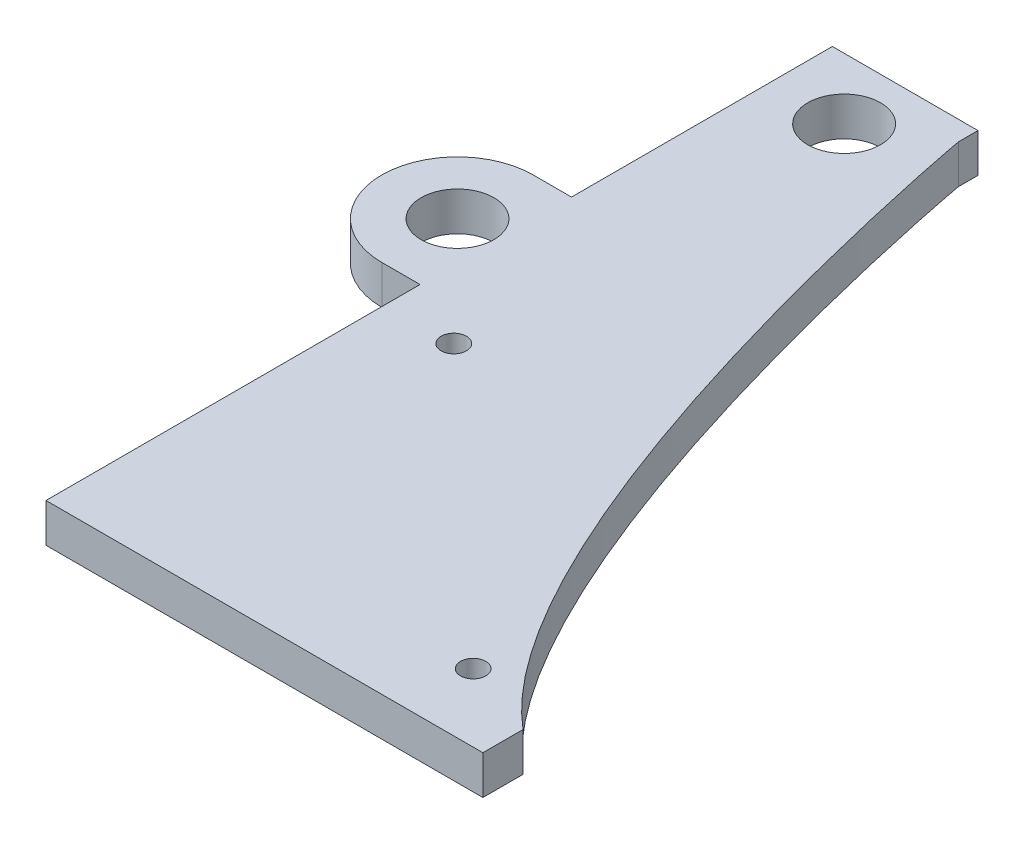
ISO-10303-21;
HEADER;
FILE_DESCRIPTION(('STEP AP214'),'2;1');
FILE_NAME('part.step','',(''),(''),'','','');
FILE_SCHEMA(('AUTOMOTIVE_DESIGN { 1 0 10303 214 1 1 1 1 }'));
ENDSEC;
DATA;
#1=APPLICATION_CONTEXT('core data for automotive mechanical design processes');
#2=APPLICATION_PROTOCOL_DEFINITION('international standard','automotive_design',2000,#1);
#3=PRODUCT_CONTEXT('',#1,'mechanical');
#4=PRODUCT('Part','Part','',(#3));
#5=PRODUCT_RELATED_PRODUCT_CATEGORY('part','',(#4));
#6=PRODUCT_DEFINITION_FORMATION('','',#4);
#7=PRODUCT_DEFINITION_CONTEXT('part definition',#1,'design');
#8=PRODUCT_DEFINITION('design','',#6,#7);
#9=PRODUCT_DEFINITION_SHAPE('','',#8);
#10=(LENGTH_UNIT() NAMED_UNIT(*) SI_UNIT(.MILLI.,.METRE.));
#11=(NAMED_UNIT(*) PLANE_ANGLE_UNIT() SI_UNIT($,.RADIAN.));
#12=(NAMED_UNIT(*) SI_UNIT($,.STERADIAN.) SOLID_ANGLE_UNIT());
#13=UNCERTAINTY_MEASURE_WITH_UNIT(LENGTH_MEASURE(1.E-05),#10,'distance_accuracy_value','');
#14=(GEOMETRIC_REPRESENTATION_CONTEXT(3) GLOBAL_UNCERTAINTY_ASSIGNED_CONTEXT((#13)) GLOBAL_UNIT_ASSIGNED_CONTEXT((#10,
#11,#12)) REPRESENTATION_CONTEXT('',''));
#15=CARTESIAN_POINT('',(0.,0.,0.));
#16=DIRECTION('',(0.,0.,1.));
#17=DIRECTION('',(1.,0.,0.));
#18=AXIS2_PLACEMENT_3D('',#15,#16,#17);
#19=CARTESIAN_POINT('',(-9.525,5.08,48.8950000000001));
#20=DIRECTION('',(1.,0.,0.));
#21=DIRECTION('',(0.,0.,-1.));
#22=AXIS2_PLACEMENT_3D('',#19,#20,#21);
#23=PLANE('',#22);
#24=DIRECTION('',(0.,0.,1.));
#25=VECTOR('',#24,1.);
#26=CARTESIAN_POINT('',(-9.525,5.08,48.8950000000001));
#27=LINE('',#26,#25);
#28=CARTESIAN_POINT('',(-9.52499999999999,5.08,-0.0375919999999405));
#29=VERTEX_POINT('',#28);
#30=CARTESIAN_POINT('',(-9.525,5.08,48.8950000000001));
#31=VERTEX_POINT('',#30);
#32=EDGE_CURVE('E55',#29,#31,#27,.T.);
#33=ORIENTED_EDGE('',*,*,#32,.F.);
#34=DIRECTION('',(0.,-1.,0.));
#35=VECTOR('',#34,1.);
#36=CARTESIAN_POINT('',(-9.52499999999998,5.08,-0.0375919999999405));
#37=LINE('',#36,#35);
#38=CARTESIAN_POINT('',(-9.52499999999999,0.,-0.0375919999999405));
#39=VERTEX_POINT('',#38);
#40=EDGE_CURVE('E245',#29,#39,#37,.T.);
#41=ORIENTED_EDGE('',*,*,#40,.T.);
#42=DIRECTION('',(0.,0.,1.));
#43=VECTOR('',#42,1.);
#44=CARTESIAN_POINT('',(-9.525,0.,48.8950000000001));
#45=LINE('',#44,#43);
#46=CARTESIAN_POINT('',(-9.525,0.,48.8950000000001));
#47=VERTEX_POINT('',#46);
#48=EDGE_CURVE('E152',#39,#47,#45,.T.);
#49=ORIENTED_EDGE('',*,*,#48,.T.);
#50=DIRECTION('',(0.,-1.,0.));
#51=VECTOR('',#50,1.);
#52=CARTESIAN_POINT('',(-9.525,5.08,48.8950000000001));
#53=LINE('',#52,#51);
#54=EDGE_CURVE('E156',#31,#47,#53,.T.);
#55=ORIENTED_EDGE('',*,*,#54,.F.);
#56=EDGE_LOOP('',(#33,#41,#49,#55));
#57=FACE_BOUND('',#56,.T.);
#58=ADVANCED_FACE('F37',(#57),#23,.F.);
#59=CARTESIAN_POINT('',(22.7352910938507,5.08,-1.18732961513015));
#60=DIRECTION('',(0.,-1.,0.));
#61=DIRECTION('',(0.,0.,-1.));
#62=AXIS2_PLACEMENT_3D('',#59,#60,#61);
#63=PLANE('',#62);
#64=DIRECTION('',(1.,0.,0.));
#65=VECTOR('',#64,1.);
#66=CARTESIAN_POINT('',(60.325,5.08,48.8950000000001));
#67=LINE('',#66,#65);
#68=CARTESIAN_POINT('',(47.625,5.08,48.8950000000001));
#69=VERTEX_POINT('',#68);
#70=EDGE_CURVE('E186',#31,#69,#67,.T.);
#71=ORIENTED_EDGE('',*,*,#70,.T.);
#72=DIRECTION('',(0.,0.,-1.));
#73=VECTOR('',#72,1.);
#74=CARTESIAN_POINT('',(47.625,5.08,48.8950000000001));
#75=LINE('',#74,#73);
#76=CARTESIAN_POINT('',(47.625,5.08,43.6464868260698));
#77=VERTEX_POINT('',#76);
#78=EDGE_CURVE('E209',#69,#77,#75,.T.);
#79=ORIENTED_EDGE('',*,*,#78,.T.);
#80=CARTESIAN_POINT('',(60.325,5.08,48.895));
#81=CARTESIAN_POINT('',(27.8191095836019,5.08,48.895));
#82=CARTESIAN_POINT('',(9.525,5.08,-51.214545640347));
#83=CARTESIAN_POINT('',(9.525,5.08,-51.435));
#84=B_SPLINE_CURVE_WITH_KNOTS('',3,(#80,#81,#82,#83),.UNSPECIFIED.,.F.,.F.,(4,4),(0.,1.),.UNSPECIFIED.);
#85=CARTESIAN_POINT('',(9.525,5.08,-51.435));
#86=VERTEX_POINT('',#85);
#87=EDGE_CURVE('E136',#77,#86,#84,.T.);
#88=ORIENTED_EDGE('',*,*,#87,.T.);
#89=DIRECTION('',(0.,0.,-1.));
#90=VECTOR('',#89,1.);
#91=CARTESIAN_POINT('',(9.525,5.08,-51.435));
#92=LINE('',#91,#90);
#93=CARTESIAN_POINT('',(9.52499999999999,5.08,-53.9749999999999));
#94=VERTEX_POINT('',#93);
#95=EDGE_CURVE('E143',#86,#94,#92,.T.);
#96=ORIENTED_EDGE('',*,*,#95,.T.);
#97=DIRECTION('',(-1.,0.,0.));
#98=VECTOR('',#97,1.);
#99=CARTESIAN_POINT('',(-9.52499999999998,5.08,-53.9749999999999));
#100=LINE('',#99,#98);
#101=CARTESIAN_POINT('',(-9.52499999999998,5.08,-53.9749999999999));
#102=VERTEX_POINT('',#101);
#103=EDGE_CURVE('E146',#94,#102,#100,.T.);
#104=ORIENTED_EDGE('',*,*,#103,.T.);
#105=CARTESIAN_POINT('',(-9.52499999999999,5.08,-19.8495919999999));
#106=VERTEX_POINT('',#105);
#107=EDGE_CURVE('E262',#102,#106,#27,.T.);
#108=ORIENTED_EDGE('',*,*,#107,.T.);
#109=DIRECTION('',(1.,0.,0.));
#110=VECTOR('',#109,1.);
#111=CARTESIAN_POINT('',(-14.535912,5.08,-19.8495919999999));
#112=LINE('',#111,#110);
#113=CARTESIAN_POINT('',(-14.535912,5.08,-19.8495919999999));
#114=VERTEX_POINT('',#113);
#115=EDGE_CURVE('E227',#114,#106,#112,.T.);
#116=ORIENTED_EDGE('',*,*,#115,.F.);
#117=CARTESIAN_POINT('',(-14.535912,5.08,-9.94359199999994));
#118=DIRECTION('',(0.,-1.,0.));
#119=DIRECTION('',(0.,0.,-1.));
#120=AXIS2_PLACEMENT_3D('',#117,#118,#119);
#121=CIRCLE('',#120,9.906);
#122=CARTESIAN_POINT('',(-14.535912,5.08,-0.0375919999999405));
#123=VERTEX_POINT('',#122);
#124=EDGE_CURVE('E224',#123,#114,#121,.T.);
#125=ORIENTED_EDGE('',*,*,#124,.F.);
#126=DIRECTION('',(-1.,0.,0.));
#127=VECTOR('',#126,1.);
#128=CARTESIAN_POINT('',(-14.535912,5.08,-0.0375919999999405));
#129=LINE('',#128,#127);
#130=EDGE_CURVE('E231',#29,#123,#129,.T.);
#131=ORIENTED_EDGE('',*,*,#130,.F.);
#132=ORIENTED_EDGE('',*,*,#32,.T.);
#133=EDGE_LOOP('',(#71,#79,#88,#96,#104,#108,#116,#125,#131,#132));
#134=FACE_BOUND('',#133,.T.);
#135=CARTESIAN_POINT('',(37.465,5.08,40.0050000000001));
#136=DIRECTION('',(0.,-1.,0.));
#137=DIRECTION('',(0.,0.,-1.));
#138=AXIS2_PLACEMENT_3D('',#135,#136,#137);
#139=CIRCLE('',#138,1.651);
#140=CARTESIAN_POINT('',(37.465,5.08,38.3540000000001));
#141=VERTEX_POINT('',#140);
#142=EDGE_CURVE('E249',#141,#141,#139,.T.);
#143=ORIENTED_EDGE('',*,*,#142,.T.);
#144=EDGE_LOOP('',(#143));
#145=FACE_BOUND('',#144,.T.);
#146=CARTESIAN_POINT('',(-0.634999999999997,5.08,4.44500000000005));
#147=DIRECTION('',(0.,-1.,0.));
#148=DIRECTION('',(0.,0.,-1.));
#149=AXIS2_PLACEMENT_3D('',#146,#147,#148);
#150=CIRCLE('',#149,1.66072838208594);
#151=CARTESIAN_POINT('',(-0.634999999999997,5.08,2.78427161791411));
#152=VERTEX_POINT('',#151);
#153=EDGE_CURVE('E244',#152,#152,#150,.T.);
#154=ORIENTED_EDGE('',*,*,#153,.T.);
#155=EDGE_LOOP('',(#154));
#156=FACE_BOUND('',#155,.T.);
#157=CARTESIAN_POINT('',(0.,5.08,-45.9866999999999));
#158=DIRECTION('',(0.,1.,0.));
#159=DIRECTION('',(0.,0.,1.));
#160=AXIS2_PLACEMENT_3D('',#157,#158,#159);
#161=CIRCLE('',#160,4.7625);
#162=CARTESIAN_POINT('',(0.,5.08,-41.2241999999999));
#163=VERTEX_POINT('',#162);
#164=EDGE_CURVE('E194',#163,#163,#161,.T.);
#165=ORIENTED_EDGE('',*,*,#164,.F.);
#166=EDGE_LOOP('',(#165));
#167=FACE_BOUND('',#166,.T.);
#168=CARTESIAN_POINT('',(-14.535912,5.08,-9.94359199999994));
#169=DIRECTION('',(0.,-1.,0.));
#170=DIRECTION('',(0.,0.,-1.));
#171=AXIS2_PLACEMENT_3D('',#168,#169,#170);
#172=CIRCLE('',#171,4.7625);
#173=CARTESIAN_POINT('',(-14.535912,5.08,-14.7060919999999));
#174=VERTEX_POINT('',#173);
#175=EDGE_CURVE('E218',#174,#174,#172,.T.);
#176=ORIENTED_EDGE('',*,*,#175,.T.);
#177=EDGE_LOOP('',(#176));
#178=FACE_BOUND('',#177,.T.);
#179=ADVANCED_FACE('F207',(#134,#145,#156,#167,#178),#63,.F.);
#180=CARTESIAN_POINT('',(22.7352910938507,0.,-1.18732961513015));
#181=DIRECTION('',(0.,-1.,0.));
#182=DIRECTION('',(0.,0.,-1.));
#183=AXIS2_PLACEMENT_3D('',#180,#181,#182);
#184=PLANE('',#183);
#185=DIRECTION('',(0.,0.,-1.));
#186=VECTOR('',#185,1.);
#187=CARTESIAN_POINT('',(47.625,0.,-1.18732961513015));
#188=LINE('',#187,#186);
#189=CARTESIAN_POINT('',(47.625,0.,48.8950000000001));
#190=VERTEX_POINT('',#189);
#191=CARTESIAN_POINT('',(47.6249998081775,-5.71561488004399E-06,43.6464870543832));
#192=VERTEX_POINT('',#191);
#193=EDGE_CURVE('E118',#190,#192,#188,.T.);
#194=ORIENTED_EDGE('',*,*,#193,.F.);
#195=DIRECTION('',(1.,0.,0.));
#196=VECTOR('',#195,1.);
#197=CARTESIAN_POINT('',(60.325,0.,48.8950000000001));
#198=LINE('',#197,#196);
#199=EDGE_CURVE('E144',#47,#190,#198,.T.);
#200=ORIENTED_EDGE('',*,*,#199,.F.);
#201=ORIENTED_EDGE('',*,*,#48,.F.);
#202=DIRECTION('',(-1.,0.,0.));
#203=VECTOR('',#202,1.);
#204=CARTESIAN_POINT('',(-14.535912,0.,-0.0375919999999405));
#205=LINE('',#204,#203);
#206=CARTESIAN_POINT('',(-14.535912,0.,-0.0375919999999405));
#207=VERTEX_POINT('',#206);
#208=EDGE_CURVE('E228',#39,#207,#205,.T.);
#209=ORIENTED_EDGE('',*,*,#208,.T.);
#210=CARTESIAN_POINT('',(-14.535912,0.,-9.94359199999994));
#211=DIRECTION('',(0.,-1.,0.));
#212=DIRECTION('',(0.,0.,-1.));
#213=AXIS2_PLACEMENT_3D('',#210,#211,#212);
#214=CIRCLE('',#213,9.906);
#215=CARTESIAN_POINT('',(-14.535912,0.,-19.8495919999999));
#216=VERTEX_POINT('',#215);
#217=EDGE_CURVE('E221',#207,#216,#214,.T.);
#218=ORIENTED_EDGE('',*,*,#217,.T.);
#219=DIRECTION('',(1.,0.,0.));
#220=VECTOR('',#219,1.);
#221=CARTESIAN_POINT('',(-14.535912,0.,-19.8495919999999));
#222=LINE('',#221,#220);
#223=CARTESIAN_POINT('',(-9.52499999999999,0.,-19.8495919999999));
#224=VERTEX_POINT('',#223);
#225=EDGE_CURVE('E237',#216,#224,#222,.T.);
#226=ORIENTED_EDGE('',*,*,#225,.T.);
#227=CARTESIAN_POINT('',(-9.52499999999998,0.,-53.9749999999999));
#228=VERTEX_POINT('',#227);
#229=EDGE_CURVE('E148',#228,#224,#45,.T.);
#230=ORIENTED_EDGE('',*,*,#229,.F.);
#231=DIRECTION('',(-1.,0.,0.));
#232=VECTOR('',#231,1.);
#233=CARTESIAN_POINT('',(-9.52499999999998,0.,-53.9749999999999));
#234=LINE('',#233,#232);
#235=CARTESIAN_POINT('',(9.52499999999999,0.,-53.9749999999999));
#236=VERTEX_POINT('',#235);
#237=EDGE_CURVE('E188',#236,#228,#234,.T.);
#238=ORIENTED_EDGE('',*,*,#237,.F.);
#239=DIRECTION('',(0.,0.,-1.));
#240=VECTOR('',#239,1.);
#241=CARTESIAN_POINT('',(9.525,0.,-51.435));
#242=LINE('',#241,#240);
#243=CARTESIAN_POINT('',(9.525,0.,-51.435));
#244=VERTEX_POINT('',#243);
#245=EDGE_CURVE('E142',#244,#236,#242,.T.);
#246=ORIENTED_EDGE('',*,*,#245,.F.);
#247=CARTESIAN_POINT('',(47.6250000000057,0.,43.6464868260746));
#248=CARTESIAN_POINT('',(23.0942696480815,0.,23.0353519203788));
#249=CARTESIAN_POINT('',(9.525,0.,-51.2451365841421));
#250=CARTESIAN_POINT('',(9.525,0.,-51.435));
#251=B_SPLINE_CURVE_WITH_KNOTS('',3,(#247,#248,#249,#250),.UNSPECIFIED.,.F.,.F.,(4,4),
(0.138763160969951,1.),.UNSPECIFIED.);
#252=EDGE_CURVE('E134',#192,#244,#251,.T.);
#253=ORIENTED_EDGE('',*,*,#252,.F.);
#254=EDGE_LOOP('',(#194,#200,#201,#209,#218,#226,#230,#238,#246,#253));
#255=FACE_BOUND('',#254,.T.);
#256=CARTESIAN_POINT('',(37.465,0.,40.0050000000001));
#257=DIRECTION('',(0.,-1.,0.));
#258=DIRECTION('',(0.,0.,-1.));
#259=AXIS2_PLACEMENT_3D('',#256,#257,#258);
#260=CIRCLE('',#259,1.651);
#261=CARTESIAN_POINT('',(37.465,0.,38.3540000000001));
#262=VERTEX_POINT('',#261);
#263=EDGE_CURVE('E252',#262,#262,#260,.T.);
#264=ORIENTED_EDGE('',*,*,#263,.F.);
#265=EDGE_LOOP('',(#264));
#266=FACE_BOUND('',#265,.T.);
#267=CARTESIAN_POINT('',(-0.634999999999997,0.,4.44500000000005));
#268=DIRECTION('',(0.,-1.,0.));
#269=DIRECTION('',(0.,0.,-1.));
#270=AXIS2_PLACEMENT_3D('',#267,#268,#269);
#271=CIRCLE('',#270,1.66072838208594);
#272=CARTESIAN_POINT('',(-0.634999999999997,0.,2.78427161791411));
#273=VERTEX_POINT('',#272);
#274=EDGE_CURVE('E255',#273,#273,#271,.T.);
#275=ORIENTED_EDGE('',*,*,#274,.F.);
#276=EDGE_LOOP('',(#275));
#277=FACE_BOUND('',#276,.T.);
#278=CARTESIAN_POINT('',(0.,0.,-45.9866999999999));
#279=DIRECTION('',(0.,1.,0.));
#280=DIRECTION('',(0.,0.,1.));
#281=AXIS2_PLACEMENT_3D('',#278,#279,#280);
#282=CIRCLE('',#281,4.7625);
#283=CARTESIAN_POINT('',(0.,0.,-41.2241999999999));
#284=VERTEX_POINT('',#283);
#285=EDGE_CURVE('E199',#284,#284,#282,.T.);
#286=ORIENTED_EDGE('',*,*,#285,.T.);
#287=EDGE_LOOP('',(#286));
#288=FACE_BOUND('',#287,.T.);
#289=CARTESIAN_POINT('',(-14.535912,0.,-9.94359199999994));
#290=DIRECTION('',(0.,-1.,0.));
#291=DIRECTION('',(0.,0.,-1.));
#292=AXIS2_PLACEMENT_3D('',#289,#290,#291);
#293=CIRCLE('',#292,4.7625);
#294=CARTESIAN_POINT('',(-14.535912,0.,-14.7060919999999));
#295=VERTEX_POINT('',#294);
#296=EDGE_CURVE('E128',#295,#295,#293,.T.);
#297=ORIENTED_EDGE('',*,*,#296,.F.);
#298=EDGE_LOOP('',(#297));
#299=FACE_BOUND('',#298,.T.);
#300=ADVANCED_FACE('F139',(#255,#266,#277,#288,#299),#184,.T.);
#301=CARTESIAN_POINT('',(9.525,5.08,-51.435));
#302=DIRECTION('',(-1.,0.,0.));
#303=DIRECTION('',(0.,0.,1.));
#304=AXIS2_PLACEMENT_3D('',#301,#302,#303);
#305=PLANE('',#304);
#306=ORIENTED_EDGE('',*,*,#245,.T.);
#307=DIRECTION('',(0.,-1.,0.));
#308=VECTOR('',#307,1.);
#309=CARTESIAN_POINT('',(9.52499999999999,5.08,-53.9749999999999));
#310=LINE('',#309,#308);
#311=EDGE_CURVE('E11',#94,#236,#310,.T.);
#312=ORIENTED_EDGE('',*,*,#311,.F.);
#313=ORIENTED_EDGE('',*,*,#95,.F.);
#314=DIRECTION('',(0.,-1.,0.));
#315=VECTOR('',#314,1.);
#316=CARTESIAN_POINT('',(9.525,5.08,-51.435));
#317=LINE('',#316,#315);
#318=EDGE_CURVE('E158',#86,#244,#317,.T.);
#319=ORIENTED_EDGE('',*,*,#318,.T.);
#320=EDGE_LOOP('',(#306,#312,#313,#319));
#321=FACE_BOUND('',#320,.T.);
#322=ADVANCED_FACE('F39',(#321),#305,.F.);
#323=CARTESIAN_POINT('',(-9.52499999999998,5.08,-53.9749999999999));
#324=DIRECTION('',(0.,0.,1.));
#325=DIRECTION('',(1.,0.,0.));
#326=AXIS2_PLACEMENT_3D('',#323,#324,#325);
#327=PLANE('',#326);
#328=ORIENTED_EDGE('',*,*,#237,.T.);
#329=DIRECTION('',(0.,-1.,0.));
#330=VECTOR('',#329,1.);
#331=CARTESIAN_POINT('',(-9.52499999999998,5.08,-53.9749999999999));
#332=LINE('',#331,#330);
#333=EDGE_CURVE('E47',#102,#228,#332,.T.);
#334=ORIENTED_EDGE('',*,*,#333,.F.);
#335=ORIENTED_EDGE('',*,*,#103,.F.);
#336=ORIENTED_EDGE('',*,*,#311,.T.);
#337=EDGE_LOOP('',(#328,#334,#335,#336));
#338=FACE_BOUND('',#337,.T.);
#339=ADVANCED_FACE('F274',(#338),#327,.F.);
#340=ORIENTED_EDGE('',*,*,#229,.T.);
#341=DIRECTION('',(0.,-1.,0.));
#342=VECTOR('',#341,1.);
#343=CARTESIAN_POINT('',(-9.52499999999998,5.08,-19.8495919999999));
#344=LINE('',#343,#342);
#345=EDGE_CURVE('E63',#106,#224,#344,.T.);
#346=ORIENTED_EDGE('',*,*,#345,.F.);
#347=ORIENTED_EDGE('',*,*,#107,.F.);
#348=ORIENTED_EDGE('',*,*,#333,.T.);
#349=EDGE_LOOP('',(#340,#346,#347,#348));
#350=FACE_BOUND('',#349,.T.);
#351=ADVANCED_FACE('F268',(#350),#23,.F.);
#352=CARTESIAN_POINT('',(60.325,5.08,48.8950000000001));
#353=DIRECTION('',(0.,0.,-1.));
#354=DIRECTION('',(-1.,0.,0.));
#355=AXIS2_PLACEMENT_3D('',#352,#353,#354);
#356=PLANE('',#355);
#357=ORIENTED_EDGE('',*,*,#199,.T.);
#358=DIRECTION('',(0.,-1.,0.));
#359=VECTOR('',#358,1.);
#360=CARTESIAN_POINT('',(47.625,5.08,48.8950000000001));
#361=LINE('',#360,#359);
#362=EDGE_CURVE('E125',#69,#190,#361,.T.);
#363=ORIENTED_EDGE('',*,*,#362,.F.);
#364=ORIENTED_EDGE('',*,*,#70,.F.);
#365=ORIENTED_EDGE('',*,*,#54,.T.);
#366=EDGE_LOOP('',(#357,#363,#364,#365));
#367=FACE_BOUND('',#366,.T.);
#368=ADVANCED_FACE('F178',(#367),#356,.F.);
#369=DIRECTION('',(0.,-1.,0.));
#370=VECTOR('',#369,1.);
#371=SURFACE_OF_LINEAR_EXTRUSION('',#84,#370);
#372=ORIENTED_EDGE('',*,*,#87,.F.);
#373=DIRECTION('',(0.,-1.,0.));
#374=VECTOR('',#373,1.);
#375=CARTESIAN_POINT('',(47.625,2.54,43.6464868260698));
#376=LINE('',#375,#374);
#377=EDGE_CURVE('E122',#77,#192,#376,.T.);
#378=ORIENTED_EDGE('',*,*,#377,.T.);
#379=ORIENTED_EDGE('',*,*,#252,.T.);
#380=ORIENTED_EDGE('',*,*,#318,.F.);
#381=EDGE_LOOP('',(#372,#378,#379,#380));
#382=FACE_BOUND('',#381,.T.);
#383=ADVANCED_FACE('F132',(#382),#371,.F.);
#384=CARTESIAN_POINT('',(0.,5.08,-45.9866999999999));
#385=DIRECTION('',(0.,-1.,0.));
#386=DIRECTION('',(0.,0.,-1.));
#387=AXIS2_PLACEMENT_3D('',#384,#385,#386);
#388=CYLINDRICAL_SURFACE('',#387,4.7625);
#389=ORIENTED_EDGE('',*,*,#164,.T.);
#390=EDGE_LOOP('',(#389));
#391=FACE_BOUND('',#390,.T.);
#392=ORIENTED_EDGE('',*,*,#285,.F.);
#393=EDGE_LOOP('',(#392));
#394=FACE_BOUND('',#393,.T.);
#395=ADVANCED_FACE('F177',(#391,#394),#388,.F.);
#396=CARTESIAN_POINT('',(-0.634999999999997,5.08,4.44500000000005));
#397=DIRECTION('',(0.,-1.,0.));
#398=DIRECTION('',(0.,0.,-1.));
#399=AXIS2_PLACEMENT_3D('',#396,#397,#398);
#400=CYLINDRICAL_SURFACE('',#399,1.66072838208594);
#401=ORIENTED_EDGE('',*,*,#153,.F.);
#402=EDGE_LOOP('',(#401));
#403=FACE_BOUND('',#402,.T.);
#404=ORIENTED_EDGE('',*,*,#274,.T.);
#405=EDGE_LOOP('',(#404));
#406=FACE_BOUND('',#405,.T.);
#407=ADVANCED_FACE('F359',(#403,#406),#400,.F.);
#408=CARTESIAN_POINT('',(37.465,5.08,40.0050000000001));
#409=DIRECTION('',(0.,-1.,0.));
#410=DIRECTION('',(0.,0.,-1.));
#411=AXIS2_PLACEMENT_3D('',#408,#409,#410);
#412=CYLINDRICAL_SURFACE('',#411,1.651);
#413=ORIENTED_EDGE('',*,*,#142,.F.);
#414=EDGE_LOOP('',(#413));
#415=FACE_BOUND('',#414,.T.);
#416=ORIENTED_EDGE('',*,*,#263,.T.);
#417=EDGE_LOOP('',(#416));
#418=FACE_BOUND('',#417,.T.);
#419=ADVANCED_FACE('F333',(#415,#418),#412,.F.);
#420=CARTESIAN_POINT('',(-14.535912,5.08,-9.94359199999994));
#421=DIRECTION('',(0.,-1.,0.));
#422=DIRECTION('',(0.,0.,-1.));
#423=AXIS2_PLACEMENT_3D('',#420,#421,#422);
#424=CYLINDRICAL_SURFACE('',#423,9.906);
#425=ORIENTED_EDGE('',*,*,#217,.F.);
#426=DIRECTION('',(0.,-1.,0.));
#427=VECTOR('',#426,1.);
#428=CARTESIAN_POINT('',(-14.535912,5.08,-0.0375919999999405));
#429=LINE('',#428,#427);
#430=EDGE_CURVE('E242',#123,#207,#429,.T.);
#431=ORIENTED_EDGE('',*,*,#430,.F.);
#432=ORIENTED_EDGE('',*,*,#124,.T.);
#433=DIRECTION('',(0.,-1.,0.));
#434=VECTOR('',#433,1.);
#435=CARTESIAN_POINT('',(-14.535912,5.08,-19.8495919999999));
#436=LINE('',#435,#434);
#437=EDGE_CURVE('E234',#114,#216,#436,.T.);
#438=ORIENTED_EDGE('',*,*,#437,.T.);
#439=EDGE_LOOP('',(#425,#431,#432,#438));
#440=FACE_BOUND('',#439,.T.);
#441=ADVANCED_FACE('F322',(#440),#424,.T.);
#442=CARTESIAN_POINT('',(-14.535912,5.08,-0.0375919999999405));
#443=DIRECTION('',(0.,0.,1.));
#444=DIRECTION('',(1.,0.,0.));
#445=AXIS2_PLACEMENT_3D('',#442,#443,#444);
#446=PLANE('',#445);
#447=ORIENTED_EDGE('',*,*,#208,.F.);
#448=ORIENTED_EDGE('',*,*,#40,.F.);
#449=ORIENTED_EDGE('',*,*,#130,.T.);
#450=ORIENTED_EDGE('',*,*,#430,.T.);
#451=EDGE_LOOP('',(#447,#448,#449,#450));
#452=FACE_BOUND('',#451,.T.);
#453=ADVANCED_FACE('F311',(#452),#446,.T.);
#454=CARTESIAN_POINT('',(-14.535912,5.08,-19.8495919999999));
#455=DIRECTION('',(0.,0.,-1.));
#456=DIRECTION('',(-1.,0.,0.));
#457=AXIS2_PLACEMENT_3D('',#454,#455,#456);
#458=PLANE('',#457);
#459=ORIENTED_EDGE('',*,*,#225,.F.);
#460=ORIENTED_EDGE('',*,*,#437,.F.);
#461=ORIENTED_EDGE('',*,*,#115,.T.);
#462=ORIENTED_EDGE('',*,*,#345,.T.);
#463=EDGE_LOOP('',(#459,#460,#461,#462));
#464=FACE_BOUND('',#463,.T.);
#465=ADVANCED_FACE('F299',(#464),#458,.T.);
#466=CARTESIAN_POINT('',(-14.535912,5.08,-9.94359199999994));
#467=DIRECTION('',(0.,-1.,0.));
#468=DIRECTION('',(0.,0.,-1.));
#469=AXIS2_PLACEMENT_3D('',#466,#467,#468);
#470=CYLINDRICAL_SURFACE('',#469,4.7625);
#471=ORIENTED_EDGE('',*,*,#175,.F.);
#472=EDGE_LOOP('',(#471));
#473=FACE_BOUND('',#472,.T.);
#474=ORIENTED_EDGE('',*,*,#296,.T.);
#475=EDGE_LOOP('',(#474));
#476=FACE_BOUND('',#475,.T.);
#477=ADVANCED_FACE('F295',(#473,#476),#470,.F.);
#478=CARTESIAN_POINT('',(47.625,5.08,48.8950000000001));
#479=DIRECTION('',(-1.,0.,0.));
#480=DIRECTION('',(0.,0.,1.));
#481=AXIS2_PLACEMENT_3D('',#478,#479,#480);
#482=PLANE('',#481);
#483=ORIENTED_EDGE('',*,*,#193,.T.);
#484=ORIENTED_EDGE('',*,*,#377,.F.);
#485=ORIENTED_EDGE('',*,*,#78,.F.);
#486=ORIENTED_EDGE('',*,*,#362,.T.);
#487=EDGE_LOOP('',(#483,#484,#485,#486));
#488=FACE_BOUND('',#487,.T.);
#489=ADVANCED_FACE('F120',(#488),#482,.F.);
#490=CLOSED_SHELL('',(#58,#179,#300,#322,#339,#351,#368,#383,#395,#407,#419,#441,#453,#465,#477,#489));
#491=MANIFOLD_SOLID_BREP('B2',#490);
#492=ADVANCED_BREP_SHAPE_REPRESENTATION('',(#18,#491),#14);
#493=SHAPE_DEFINITION_REPRESENTATION(#9,#492);
ENDSEC;
END-ISO-10303-21;
